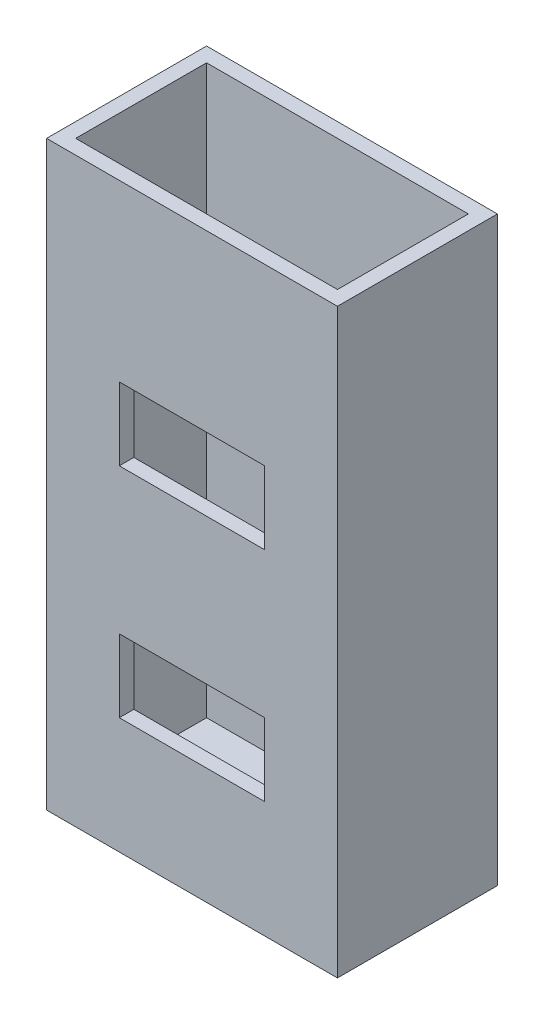
ISO-10303-21;
HEADER;
FILE_DESCRIPTION(('STEP AP214'),'2;1');
FILE_NAME('part.step','',(''),(''),'','','');
FILE_SCHEMA(('AUTOMOTIVE_DESIGN { 1 0 10303 214 1 1 1 1 }'));
ENDSEC;
DATA;
#1=APPLICATION_CONTEXT('core data for automotive mechanical design processes');
#2=APPLICATION_PROTOCOL_DEFINITION('international standard','automotive_design',2000,#1);
#3=PRODUCT_CONTEXT('',#1,'mechanical');
#4=PRODUCT('Part','Part','',(#3));
#5=PRODUCT_RELATED_PRODUCT_CATEGORY('part','',(#4));
#6=PRODUCT_DEFINITION_FORMATION('','',#4);
#7=PRODUCT_DEFINITION_CONTEXT('part definition',#1,'design');
#8=PRODUCT_DEFINITION('design','',#6,#7);
#9=PRODUCT_DEFINITION_SHAPE('','',#8);
#10=(LENGTH_UNIT() NAMED_UNIT(*) SI_UNIT(.MILLI.,.METRE.));
#11=(NAMED_UNIT(*) PLANE_ANGLE_UNIT() SI_UNIT($,.RADIAN.));
#12=(NAMED_UNIT(*) SI_UNIT($,.STERADIAN.) SOLID_ANGLE_UNIT());
#13=UNCERTAINTY_MEASURE_WITH_UNIT(LENGTH_MEASURE(1.E-05),#10,'distance_accuracy_value','');
#14=(GEOMETRIC_REPRESENTATION_CONTEXT(3) GLOBAL_UNCERTAINTY_ASSIGNED_CONTEXT((#13)) GLOBAL_UNIT_ASSIGNED_CONTEXT((#10,
#11,#12)) REPRESENTATION_CONTEXT('',''));
#15=CARTESIAN_POINT('',(0.,0.,0.));
#16=DIRECTION('',(0.,0.,1.));
#17=DIRECTION('',(1.,0.,0.));
#18=AXIS2_PLACEMENT_3D('',#15,#16,#17);
#19=CARTESIAN_POINT('',(0.,0.,11.));
#20=DIRECTION('',(0.,0.,1.));
#21=DIRECTION('',(1.,0.,0.));
#22=AXIS2_PLACEMENT_3D('',#19,#20,#21);
#23=PLANE('',#22);
#24=DIRECTION('',(0.,1.,0.));
#25=VECTOR('',#24,1.);
#26=CARTESIAN_POINT('',(-5.90971368462264,30.4024376593262,11.));
#27=LINE('',#26,#25);
#28=CARTESIAN_POINT('',(-5.90971368462263,-9.59756234067375,11.));
#29=VERTEX_POINT('',#28);
#30=CARTESIAN_POINT('',(-5.90971368462264,30.4024376593262,11.));
#31=VERTEX_POINT('',#30);
#32=EDGE_CURVE('E301',#29,#31,#27,.T.);
#33=ORIENTED_EDGE('',*,*,#32,.T.);
#34=DIRECTION('',(-1.,0.,0.));
#35=VECTOR('',#34,1.);
#36=CARTESIAN_POINT('',(-25.9097136846226,30.4024376593262,11.));
#37=LINE('',#36,#35);
#38=CARTESIAN_POINT('',(-25.9097136846226,30.4024376593262,11.));
#39=VERTEX_POINT('',#38);
#40=EDGE_CURVE('E305',#31,#39,#37,.T.);
#41=ORIENTED_EDGE('',*,*,#40,.T.);
#42=DIRECTION('',(0.,-1.,0.));
#43=VECTOR('',#42,1.);
#44=CARTESIAN_POINT('',(-25.9097136846226,30.4024376593262,11.));
#45=LINE('',#44,#43);
#46=CARTESIAN_POINT('',(-25.9097136846226,-9.59756234067375,11.));
#47=VERTEX_POINT('',#46);
#48=EDGE_CURVE('E309',#39,#47,#45,.T.);
#49=ORIENTED_EDGE('',*,*,#48,.T.);
#50=DIRECTION('',(1.,0.,0.));
#51=VECTOR('',#50,1.);
#52=CARTESIAN_POINT('',(-25.9097136846226,-9.59756234067375,11.));
#53=LINE('',#52,#51);
#54=EDGE_CURVE('E312',#47,#29,#53,.T.);
#55=ORIENTED_EDGE('',*,*,#54,.T.);
#56=EDGE_LOOP('',(#33,#41,#49,#55));
#57=FACE_BOUND('',#56,.T.);
#58=DIRECTION('',(1.,0.,0.));
#59=VECTOR('',#58,1.);
#60=CARTESIAN_POINT('',(0.,3.40243765932625,11.));
#61=LINE('',#60,#59);
#62=CARTESIAN_POINT('',(-20.9097136846226,3.40243765932625,11.));
#63=VERTEX_POINT('',#62);
#64=CARTESIAN_POINT('',(-10.9097136846226,3.40243765932625,11.));
#65=VERTEX_POINT('',#64);
#66=EDGE_CURVE('E242',#63,#65,#61,.T.);
#67=ORIENTED_EDGE('',*,*,#66,.T.);
#68=DIRECTION('',(0.,-1.,0.));
#69=VECTOR('',#68,1.);
#70=CARTESIAN_POINT('',(-10.9097136846226,0.,11.));
#71=LINE('',#70,#69);
#72=CARTESIAN_POINT('',(-10.9097136846226,-1.59756234067375,11.));
#73=VERTEX_POINT('',#72);
#74=EDGE_CURVE('E246',#65,#73,#71,.T.);
#75=ORIENTED_EDGE('',*,*,#74,.T.);
#76=DIRECTION('',(-1.,0.,0.));
#77=VECTOR('',#76,1.);
#78=CARTESIAN_POINT('',(0.,-1.59756234067375,11.));
#79=LINE('',#78,#77);
#80=CARTESIAN_POINT('',(-20.9097136846226,-1.59756234067375,11.));
#81=VERTEX_POINT('',#80);
#82=EDGE_CURVE('E214',#73,#81,#79,.T.);
#83=ORIENTED_EDGE('',*,*,#82,.T.);
#84=DIRECTION('',(0.,1.,0.));
#85=VECTOR('',#84,1.);
#86=CARTESIAN_POINT('',(-20.9097136846226,0.,11.));
#87=LINE('',#86,#85);
#88=EDGE_CURVE('E170',#81,#63,#87,.T.);
#89=ORIENTED_EDGE('',*,*,#88,.T.);
#90=EDGE_LOOP('',(#67,#75,#83,#89));
#91=FACE_BOUND('',#90,.T.);
#92=DIRECTION('',(1.,0.,0.));
#93=VECTOR('',#92,1.);
#94=CARTESIAN_POINT('',(0.,18.4024376593262,11.));
#95=LINE('',#94,#93);
#96=CARTESIAN_POINT('',(-20.9097136846226,18.4024376593262,11.));
#97=VERTEX_POINT('',#96);
#98=CARTESIAN_POINT('',(-10.9097136846226,18.4024376593262,11.));
#99=VERTEX_POINT('',#98);
#100=EDGE_CURVE('E255',#97,#99,#95,.T.);
#101=ORIENTED_EDGE('',*,*,#100,.T.);
#102=DIRECTION('',(0.,-1.,0.));
#103=VECTOR('',#102,1.);
#104=CARTESIAN_POINT('',(-10.9097136846226,0.,11.));
#105=LINE('',#104,#103);
#106=CARTESIAN_POINT('',(-10.9097136846226,13.4024376593262,11.));
#107=VERTEX_POINT('',#106);
#108=EDGE_CURVE('E212',#99,#107,#105,.T.);
#109=ORIENTED_EDGE('',*,*,#108,.T.);
#110=DIRECTION('',(-1.,0.,0.));
#111=VECTOR('',#110,1.);
#112=CARTESIAN_POINT('',(0.,13.4024376593262,11.));
#113=LINE('',#112,#111);
#114=CARTESIAN_POINT('',(-20.9097136846226,13.4024376593262,11.));
#115=VERTEX_POINT('',#114);
#116=EDGE_CURVE('E250',#107,#115,#113,.T.);
#117=ORIENTED_EDGE('',*,*,#116,.T.);
#118=DIRECTION('',(0.,1.,0.));
#119=VECTOR('',#118,1.);
#120=CARTESIAN_POINT('',(-20.9097136846226,0.,11.));
#121=LINE('',#120,#119);
#122=EDGE_CURVE('E221',#115,#97,#121,.T.);
#123=ORIENTED_EDGE('',*,*,#122,.T.);
#124=EDGE_LOOP('',(#101,#109,#117,#123));
#125=FACE_BOUND('',#124,.T.);
#126=ADVANCED_FACE('F41',(#57,#91,#125),#23,.T.);
#127=CARTESIAN_POINT('',(-24.9097136846226,-29.7221741381719,10.));
#128=DIRECTION('',(0.,0.,1.));
#129=DIRECTION('',(1.,0.,0.));
#130=AXIS2_PLACEMENT_3D('',#127,#128,#129);
#131=PLANE('',#130);
#132=DIRECTION('',(0.,-1.,0.));
#133=VECTOR('',#132,1.);
#134=CARTESIAN_POINT('',(-10.9097136846226,-29.7221741381719,10.));
#135=LINE('',#134,#133);
#136=CARTESIAN_POINT('',(-10.9097136846226,3.40243765932625,10.));
#137=VERTEX_POINT('',#136);
#138=CARTESIAN_POINT('',(-10.9097136846226,-1.59756234067375,10.));
#139=VERTEX_POINT('',#138);
#140=EDGE_CURVE('E182',#137,#139,#135,.T.);
#141=ORIENTED_EDGE('',*,*,#140,.F.);
#142=DIRECTION('',(1.,0.,0.));
#143=VECTOR('',#142,1.);
#144=CARTESIAN_POINT('',(-24.9097136846226,3.40243765932625,10.));
#145=LINE('',#144,#143);
#146=CARTESIAN_POINT('',(-20.9097136846226,3.40243765932625,10.));
#147=VERTEX_POINT('',#146);
#148=EDGE_CURVE('E178',#147,#137,#145,.T.);
#149=ORIENTED_EDGE('',*,*,#148,.F.);
#150=DIRECTION('',(0.,1.,0.));
#151=VECTOR('',#150,1.);
#152=CARTESIAN_POINT('',(-20.9097136846226,-29.7221741381719,10.));
#153=LINE('',#152,#151);
#154=CARTESIAN_POINT('',(-20.9097136846226,-1.59756234067375,10.));
#155=VERTEX_POINT('',#154);
#156=EDGE_CURVE('E162',#155,#147,#153,.T.);
#157=ORIENTED_EDGE('',*,*,#156,.F.);
#158=DIRECTION('',(-1.,0.,0.));
#159=VECTOR('',#158,1.);
#160=CARTESIAN_POINT('',(-24.9097136846226,-1.59756234067375,10.));
#161=LINE('',#160,#159);
#162=EDGE_CURVE('E153',#139,#155,#161,.T.);
#163=ORIENTED_EDGE('',*,*,#162,.F.);
#164=EDGE_LOOP('',(#141,#149,#157,#163));
#165=FACE_BOUND('',#164,.T.);
#166=DIRECTION('',(-1.,0.,0.));
#167=VECTOR('',#166,1.);
#168=CARTESIAN_POINT('',(-24.9097136846226,-8.59756234067375,10.));
#169=LINE('',#168,#167);
#170=CARTESIAN_POINT('',(-6.90971368462264,-8.59756234067375,10.));
#171=VERTEX_POINT('',#170);
#172=CARTESIAN_POINT('',(-24.9097136846226,-8.59756234067375,10.));
#173=VERTEX_POINT('',#172);
#174=EDGE_CURVE('E264',#171,#173,#169,.T.);
#175=ORIENTED_EDGE('',*,*,#174,.T.);
#176=DIRECTION('',(0.,1.,0.));
#177=VECTOR('',#176,1.);
#178=CARTESIAN_POINT('',(-24.9097136846226,-29.7221741381719,10.));
#179=LINE('',#178,#177);
#180=CARTESIAN_POINT('',(-24.9097136846226,30.4024376593262,10.));
#181=VERTEX_POINT('',#180);
#182=EDGE_CURVE('E289',#173,#181,#179,.T.);
#183=ORIENTED_EDGE('',*,*,#182,.T.);
#184=DIRECTION('',(1.,0.,0.));
#185=VECTOR('',#184,1.);
#186=CARTESIAN_POINT('',(-24.9097136846226,30.4024376593262,10.));
#187=LINE('',#186,#185);
#188=CARTESIAN_POINT('',(-6.90971368462264,30.4024376593262,10.));
#189=VERTEX_POINT('',#188);
#190=EDGE_CURVE('E282',#181,#189,#187,.T.);
#191=ORIENTED_EDGE('',*,*,#190,.T.);
#192=DIRECTION('',(0.,1.,0.));
#193=VECTOR('',#192,1.);
#194=CARTESIAN_POINT('',(-6.90971368462264,-29.7221741381719,10.));
#195=LINE('',#194,#193);
#196=EDGE_CURVE('E265',#171,#189,#195,.T.);
#197=ORIENTED_EDGE('',*,*,#196,.F.);
#198=EDGE_LOOP('',(#175,#183,#191,#197));
#199=FACE_BOUND('',#198,.T.);
#200=DIRECTION('',(0.,-1.,0.));
#201=VECTOR('',#200,1.);
#202=CARTESIAN_POINT('',(-10.9097136846226,-29.7221741381719,10.));
#203=LINE('',#202,#201);
#204=CARTESIAN_POINT('',(-10.9097136846226,18.4024376593262,10.));
#205=VERTEX_POINT('',#204);
#206=CARTESIAN_POINT('',(-10.9097136846226,13.4024376593262,10.));
#207=VERTEX_POINT('',#206);
#208=EDGE_CURVE('E12',#205,#207,#203,.T.);
#209=ORIENTED_EDGE('',*,*,#208,.F.);
#210=DIRECTION('',(1.,0.,0.));
#211=VECTOR('',#210,1.);
#212=CARTESIAN_POINT('',(-24.9097136846226,18.4024376593262,10.));
#213=LINE('',#212,#211);
#214=CARTESIAN_POINT('',(-20.9097136846226,18.4024376593262,10.));
#215=VERTEX_POINT('',#214);
#216=EDGE_CURVE('E50',#215,#205,#213,.T.);
#217=ORIENTED_EDGE('',*,*,#216,.F.);
#218=DIRECTION('',(0.,1.,0.));
#219=VECTOR('',#218,1.);
#220=CARTESIAN_POINT('',(-20.9097136846226,-29.7221741381719,10.));
#221=LINE('',#220,#219);
#222=CARTESIAN_POINT('',(-20.9097136846226,13.4024376593262,10.));
#223=VERTEX_POINT('',#222);
#224=EDGE_CURVE('E191',#223,#215,#221,.T.);
#225=ORIENTED_EDGE('',*,*,#224,.F.);
#226=DIRECTION('',(-1.,0.,0.));
#227=VECTOR('',#226,1.);
#228=CARTESIAN_POINT('',(-24.9097136846226,13.4024376593262,10.));
#229=LINE('',#228,#227);
#230=EDGE_CURVE('E188',#207,#223,#229,.T.);
#231=ORIENTED_EDGE('',*,*,#230,.F.);
#232=EDGE_LOOP('',(#209,#217,#225,#231));
#233=FACE_BOUND('',#232,.T.);
#234=ADVANCED_FACE('F176',(#165,#199,#233),#131,.F.);
#235=CARTESIAN_POINT('',(-5.90971368462264,30.4024376593262,11.));
#236=DIRECTION('',(-1.,0.,0.));
#237=DIRECTION('',(0.,-1.,0.));
#238=AXIS2_PLACEMENT_3D('',#235,#236,#237);
#239=PLANE('',#238);
#240=DIRECTION('',(0.,1.,0.));
#241=VECTOR('',#240,1.);
#242=CARTESIAN_POINT('',(-5.90971368462264,30.4024376593262,0.));
#243=LINE('',#242,#241);
#244=CARTESIAN_POINT('',(-5.90971368462263,-9.59756234067375,0.));
#245=VERTEX_POINT('',#244);
#246=CARTESIAN_POINT('',(-5.90971368462264,30.4024376593262,0.));
#247=VERTEX_POINT('',#246);
#248=EDGE_CURVE('E300',#245,#247,#243,.T.);
#249=ORIENTED_EDGE('',*,*,#248,.T.);
#250=DIRECTION('',(0.,0.,-1.));
#251=VECTOR('',#250,1.);
#252=CARTESIAN_POINT('',(-5.90971368462264,30.4024376593262,11.));
#253=LINE('',#252,#251);
#254=EDGE_CURVE('E163',#31,#247,#253,.T.);
#255=ORIENTED_EDGE('',*,*,#254,.F.);
#256=ORIENTED_EDGE('',*,*,#32,.F.);
#257=DIRECTION('',(0.,0.,-1.));
#258=VECTOR('',#257,1.);
#259=CARTESIAN_POINT('',(-5.90971368462263,-9.59756234067375,11.));
#260=LINE('',#259,#258);
#261=EDGE_CURVE('E315',#29,#245,#260,.T.);
#262=ORIENTED_EDGE('',*,*,#261,.T.);
#263=EDGE_LOOP('',(#249,#255,#256,#262));
#264=FACE_BOUND('',#263,.T.);
#265=ADVANCED_FACE('F43',(#264),#239,.F.);
#266=CARTESIAN_POINT('',(-25.9097136846226,30.4024376593262,11.));
#267=DIRECTION('',(0.,-1.,0.));
#268=DIRECTION('',(0.,0.,-1.));
#269=AXIS2_PLACEMENT_3D('',#266,#267,#268);
#270=PLANE('',#269);
#271=DIRECTION('',(-1.,0.,0.));
#272=VECTOR('',#271,1.);
#273=CARTESIAN_POINT('',(-24.9097136846226,30.4024376593262,1.));
#274=LINE('',#273,#272);
#275=CARTESIAN_POINT('',(-6.90971368462264,30.4024376593262,1.));
#276=VERTEX_POINT('',#275);
#277=CARTESIAN_POINT('',(-24.9097136846226,30.4024376593262,1.));
#278=VERTEX_POINT('',#277);
#279=EDGE_CURVE('E274',#276,#278,#274,.T.);
#280=ORIENTED_EDGE('',*,*,#279,.F.);
#281=DIRECTION('',(0.,0.,-1.));
#282=VECTOR('',#281,1.);
#283=CARTESIAN_POINT('',(-6.90971368462264,30.4024376593262,1.));
#284=LINE('',#283,#282);
#285=EDGE_CURVE('E260',#189,#276,#284,.T.);
#286=ORIENTED_EDGE('',*,*,#285,.F.);
#287=ORIENTED_EDGE('',*,*,#190,.F.);
#288=DIRECTION('',(0.,0.,1.));
#289=VECTOR('',#288,1.);
#290=CARTESIAN_POINT('',(-24.9097136846226,30.4024376593262,1.));
#291=LINE('',#290,#289);
#292=EDGE_CURVE('E278',#278,#181,#291,.T.);
#293=ORIENTED_EDGE('',*,*,#292,.F.);
#294=EDGE_LOOP('',(#280,#286,#287,#293));
#295=FACE_BOUND('',#294,.T.);
#296=DIRECTION('',(-1.,0.,0.));
#297=VECTOR('',#296,1.);
#298=CARTESIAN_POINT('',(-25.9097136846226,30.4024376593262,0.));
#299=LINE('',#298,#297);
#300=CARTESIAN_POINT('',(-25.9097136846226,30.4024376593262,0.));
#301=VERTEX_POINT('',#300);
#302=EDGE_CURVE('E319',#247,#301,#299,.T.);
#303=ORIENTED_EDGE('',*,*,#302,.T.);
#304=DIRECTION('',(0.,0.,-1.));
#305=VECTOR('',#304,1.);
#306=CARTESIAN_POINT('',(-25.9097136846226,30.4024376593262,11.));
#307=LINE('',#306,#305);
#308=EDGE_CURVE('E334',#39,#301,#307,.T.);
#309=ORIENTED_EDGE('',*,*,#308,.F.);
#310=ORIENTED_EDGE('',*,*,#40,.F.);
#311=ORIENTED_EDGE('',*,*,#254,.T.);
#312=EDGE_LOOP('',(#303,#309,#310,#311));
#313=FACE_BOUND('',#312,.T.);
#314=ADVANCED_FACE('F341',(#295,#313),#270,.F.);
#315=CARTESIAN_POINT('',(-25.9097136846226,30.4024376593262,11.));
#316=DIRECTION('',(1.,0.,0.));
#317=DIRECTION('',(0.,0.,-1.));
#318=AXIS2_PLACEMENT_3D('',#315,#316,#317);
#319=PLANE('',#318);
#320=DIRECTION('',(0.,-1.,0.));
#321=VECTOR('',#320,1.);
#322=CARTESIAN_POINT('',(-25.9097136846226,30.4024376593262,0.));
#323=LINE('',#322,#321);
#324=CARTESIAN_POINT('',(-25.9097136846226,-9.59756234067375,0.));
#325=VERTEX_POINT('',#324);
#326=EDGE_CURVE('E322',#301,#325,#323,.T.);
#327=ORIENTED_EDGE('',*,*,#326,.T.);
#328=DIRECTION('',(0.,0.,-1.));
#329=VECTOR('',#328,1.);
#330=CARTESIAN_POINT('',(-25.9097136846226,-9.59756234067375,11.));
#331=LINE('',#330,#329);
#332=EDGE_CURVE('E330',#47,#325,#331,.T.);
#333=ORIENTED_EDGE('',*,*,#332,.F.);
#334=ORIENTED_EDGE('',*,*,#48,.F.);
#335=ORIENTED_EDGE('',*,*,#308,.T.);
#336=EDGE_LOOP('',(#327,#333,#334,#335));
#337=FACE_BOUND('',#336,.T.);
#338=ADVANCED_FACE('F353',(#337),#319,.F.);
#339=CARTESIAN_POINT('',(-25.9097136846226,-9.59756234067375,11.));
#340=DIRECTION('',(0.,1.,0.));
#341=DIRECTION('',(0.,0.,1.));
#342=AXIS2_PLACEMENT_3D('',#339,#340,#341);
#343=PLANE('',#342);
#344=DIRECTION('',(1.,0.,0.));
#345=VECTOR('',#344,1.);
#346=CARTESIAN_POINT('',(-25.9097136846226,-9.59756234067375,0.));
#347=LINE('',#346,#345);
#348=EDGE_CURVE('E306',#325,#245,#347,.T.);
#349=ORIENTED_EDGE('',*,*,#348,.T.);
#350=ORIENTED_EDGE('',*,*,#261,.F.);
#351=ORIENTED_EDGE('',*,*,#54,.F.);
#352=ORIENTED_EDGE('',*,*,#332,.T.);
#353=EDGE_LOOP('',(#349,#350,#351,#352));
#354=FACE_BOUND('',#353,.T.);
#355=ADVANCED_FACE('F357',(#354),#343,.F.);
#356=CARTESIAN_POINT('',(0.,0.,0.));
#357=DIRECTION('',(0.,0.,1.));
#358=DIRECTION('',(1.,0.,0.));
#359=AXIS2_PLACEMENT_3D('',#356,#357,#358);
#360=PLANE('',#359);
#361=ORIENTED_EDGE('',*,*,#248,.F.);
#362=ORIENTED_EDGE('',*,*,#348,.F.);
#363=ORIENTED_EDGE('',*,*,#326,.F.);
#364=ORIENTED_EDGE('',*,*,#302,.F.);
#365=EDGE_LOOP('',(#361,#362,#363,#364));
#366=FACE_BOUND('',#365,.T.);
#367=ADVANCED_FACE('F349',(#366),#360,.F.);
#368=CARTESIAN_POINT('',(-6.90971368462264,-29.7221741381719,1.));
#369=DIRECTION('',(1.,0.,0.));
#370=DIRECTION('',(0.,0.,-1.));
#371=AXIS2_PLACEMENT_3D('',#368,#369,#370);
#372=PLANE('',#371);
#373=DIRECTION('',(0.,0.,1.));
#374=VECTOR('',#373,1.);
#375=CARTESIAN_POINT('',(-6.90971368462264,-8.59756234067375,1.));
#376=LINE('',#375,#374);
#377=CARTESIAN_POINT('',(-6.90971368462264,-8.59756234067375,1.));
#378=VERTEX_POINT('',#377);
#379=EDGE_CURVE('E268',#378,#171,#376,.T.);
#380=ORIENTED_EDGE('',*,*,#379,.T.);
#381=ORIENTED_EDGE('',*,*,#196,.T.);
#382=ORIENTED_EDGE('',*,*,#285,.T.);
#383=DIRECTION('',(0.,1.,0.));
#384=VECTOR('',#383,1.);
#385=CARTESIAN_POINT('',(-6.90971368462264,-29.7221741381719,1.));
#386=LINE('',#385,#384);
#387=EDGE_CURVE('E286',#378,#276,#386,.T.);
#388=ORIENTED_EDGE('',*,*,#387,.F.);
#389=EDGE_LOOP('',(#380,#381,#382,#388));
#390=FACE_BOUND('',#389,.T.);
#391=ADVANCED_FACE('F386',(#390),#372,.F.);
#392=CARTESIAN_POINT('',(-24.9097136846226,-29.7221741381719,1.));
#393=DIRECTION('',(-1.,0.,0.));
#394=DIRECTION('',(0.,0.,1.));
#395=AXIS2_PLACEMENT_3D('',#392,#393,#394);
#396=PLANE('',#395);
#397=DIRECTION('',(0.,0.,-1.));
#398=VECTOR('',#397,1.);
#399=CARTESIAN_POINT('',(-24.9097136846226,-8.59756234067375,1.));
#400=LINE('',#399,#398);
#401=CARTESIAN_POINT('',(-24.9097136846226,-8.59756234067376,1.));
#402=VERTEX_POINT('',#401);
#403=EDGE_CURVE('E261',#173,#402,#400,.T.);
#404=ORIENTED_EDGE('',*,*,#403,.T.);
#405=DIRECTION('',(0.,1.,0.));
#406=VECTOR('',#405,1.);
#407=CARTESIAN_POINT('',(-24.9097136846226,-29.7221741381719,1.));
#408=LINE('',#407,#406);
#409=EDGE_CURVE('E292',#402,#278,#408,.T.);
#410=ORIENTED_EDGE('',*,*,#409,.T.);
#411=ORIENTED_EDGE('',*,*,#292,.T.);
#412=ORIENTED_EDGE('',*,*,#182,.F.);
#413=EDGE_LOOP('',(#404,#410,#411,#412));
#414=FACE_BOUND('',#413,.T.);
#415=ADVANCED_FACE('F383',(#414),#396,.F.);
#416=CARTESIAN_POINT('',(-24.9097136846226,-29.7221741381719,1.));
#417=DIRECTION('',(0.,0.,-1.));
#418=DIRECTION('',(-1.,0.,0.));
#419=AXIS2_PLACEMENT_3D('',#416,#417,#418);
#420=PLANE('',#419);
#421=DIRECTION('',(1.,0.,0.));
#422=VECTOR('',#421,1.);
#423=CARTESIAN_POINT('',(-24.9097136846226,-8.59756234067375,1.));
#424=LINE('',#423,#422);
#425=EDGE_CURVE('E271',#402,#378,#424,.T.);
#426=ORIENTED_EDGE('',*,*,#425,.T.);
#427=ORIENTED_EDGE('',*,*,#387,.T.);
#428=ORIENTED_EDGE('',*,*,#279,.T.);
#429=ORIENTED_EDGE('',*,*,#409,.F.);
#430=EDGE_LOOP('',(#426,#427,#428,#429));
#431=FACE_BOUND('',#430,.T.);
#432=ADVANCED_FACE('F376',(#431),#420,.F.);
#433=CARTESIAN_POINT('',(-25.9097136846226,-8.59756234067375,11.));
#434=DIRECTION('',(0.,1.,0.));
#435=DIRECTION('',(0.,0.,1.));
#436=AXIS2_PLACEMENT_3D('',#433,#434,#435);
#437=PLANE('',#436);
#438=ORIENTED_EDGE('',*,*,#379,.F.);
#439=ORIENTED_EDGE('',*,*,#425,.F.);
#440=ORIENTED_EDGE('',*,*,#403,.F.);
#441=ORIENTED_EDGE('',*,*,#174,.F.);
#442=EDGE_LOOP('',(#438,#439,#440,#441));
#443=FACE_BOUND('',#442,.T.);
#444=ADVANCED_FACE('F369',(#443),#437,.T.);
#445=CARTESIAN_POINT('',(-10.9097136846226,3.40243765932625,17.));
#446=DIRECTION('',(-1.,0.,0.));
#447=DIRECTION('',(0.,0.,1.));
#448=AXIS2_PLACEMENT_3D('',#445,#446,#447);
#449=PLANE('',#448);
#450=DIRECTION('',(0.,0.,-1.));
#451=VECTOR('',#450,1.);
#452=CARTESIAN_POINT('',(-10.9097136846226,3.40243765932625,17.));
#453=LINE('',#452,#451);
#454=EDGE_CURVE('E228',#65,#137,#453,.T.);
#455=ORIENTED_EDGE('',*,*,#454,.T.);
#456=ORIENTED_EDGE('',*,*,#140,.T.);
#457=DIRECTION('',(0.,0.,-1.));
#458=VECTOR('',#457,1.);
#459=CARTESIAN_POINT('',(-10.9097136846226,-1.59756234067375,17.));
#460=LINE('',#459,#458);
#461=EDGE_CURVE('E156',#73,#139,#460,.T.);
#462=ORIENTED_EDGE('',*,*,#461,.F.);
#463=ORIENTED_EDGE('',*,*,#74,.F.);
#464=EDGE_LOOP('',(#455,#456,#462,#463));
#465=FACE_BOUND('',#464,.T.);
#466=ADVANCED_FACE('F367',(#465),#449,.T.);
#467=CARTESIAN_POINT('',(-20.9097136846226,3.40243765932625,17.));
#468=DIRECTION('',(0.,-1.,0.));
#469=DIRECTION('',(0.,0.,-1.));
#470=AXIS2_PLACEMENT_3D('',#467,#468,#469);
#471=PLANE('',#470);
#472=DIRECTION('',(0.,0.,-1.));
#473=VECTOR('',#472,1.);
#474=CARTESIAN_POINT('',(-20.9097136846226,3.40243765932625,17.));
#475=LINE('',#474,#473);
#476=EDGE_CURVE('E173',#63,#147,#475,.T.);
#477=ORIENTED_EDGE('',*,*,#476,.T.);
#478=ORIENTED_EDGE('',*,*,#148,.T.);
#479=ORIENTED_EDGE('',*,*,#454,.F.);
#480=ORIENTED_EDGE('',*,*,#66,.F.);
#481=EDGE_LOOP('',(#477,#478,#479,#480));
#482=FACE_BOUND('',#481,.T.);
#483=ADVANCED_FACE('F365',(#482),#471,.T.);
#484=CARTESIAN_POINT('',(-20.9097136846226,3.40243765932625,17.));
#485=DIRECTION('',(1.,0.,0.));
#486=DIRECTION('',(0.,1.,0.));
#487=AXIS2_PLACEMENT_3D('',#484,#485,#486);
#488=PLANE('',#487);
#489=DIRECTION('',(0.,0.,-1.));
#490=VECTOR('',#489,1.);
#491=CARTESIAN_POINT('',(-20.9097136846226,-1.59756234067375,17.));
#492=LINE('',#491,#490);
#493=EDGE_CURVE('E65',#81,#155,#492,.T.);
#494=ORIENTED_EDGE('',*,*,#493,.T.);
#495=ORIENTED_EDGE('',*,*,#156,.T.);
#496=ORIENTED_EDGE('',*,*,#476,.F.);
#497=ORIENTED_EDGE('',*,*,#88,.F.);
#498=EDGE_LOOP('',(#494,#495,#496,#497));
#499=FACE_BOUND('',#498,.T.);
#500=ADVANCED_FACE('F166',(#499),#488,.T.);
#501=CARTESIAN_POINT('',(-20.9097136846226,-1.59756234067375,17.));
#502=DIRECTION('',(0.,1.,0.));
#503=DIRECTION('',(0.,0.,1.));
#504=AXIS2_PLACEMENT_3D('',#501,#502,#503);
#505=PLANE('',#504);
#506=ORIENTED_EDGE('',*,*,#461,.T.);
#507=ORIENTED_EDGE('',*,*,#162,.T.);
#508=ORIENTED_EDGE('',*,*,#493,.F.);
#509=ORIENTED_EDGE('',*,*,#82,.F.);
#510=EDGE_LOOP('',(#506,#507,#508,#509));
#511=FACE_BOUND('',#510,.T.);
#512=ADVANCED_FACE('F154',(#511),#505,.T.);
#513=CARTESIAN_POINT('',(-10.9097136846226,18.4024376593262,17.));
#514=DIRECTION('',(-1.,0.,0.));
#515=DIRECTION('',(0.,-1.,0.));
#516=AXIS2_PLACEMENT_3D('',#513,#514,#515);
#517=PLANE('',#516);
#518=DIRECTION('',(0.,0.,-1.));
#519=VECTOR('',#518,1.);
#520=CARTESIAN_POINT('',(-10.9097136846226,18.4024376593262,17.));
#521=LINE('',#520,#519);
#522=EDGE_CURVE('E200',#99,#205,#521,.T.);
#523=ORIENTED_EDGE('',*,*,#522,.T.);
#524=ORIENTED_EDGE('',*,*,#208,.T.);
#525=DIRECTION('',(0.,0.,-1.));
#526=VECTOR('',#525,1.);
#527=CARTESIAN_POINT('',(-10.9097136846226,13.4024376593262,17.));
#528=LINE('',#527,#526);
#529=EDGE_CURVE('E217',#107,#207,#528,.T.);
#530=ORIENTED_EDGE('',*,*,#529,.F.);
#531=ORIENTED_EDGE('',*,*,#108,.F.);
#532=EDGE_LOOP('',(#523,#524,#530,#531));
#533=FACE_BOUND('',#532,.T.);
#534=ADVANCED_FACE('F208',(#533),#517,.T.);
#535=CARTESIAN_POINT('',(-20.9097136846226,18.4024376593262,17.));
#536=DIRECTION('',(0.,-1.,0.));
#537=DIRECTION('',(0.,0.,-1.));
#538=AXIS2_PLACEMENT_3D('',#535,#536,#537);
#539=PLANE('',#538);
#540=DIRECTION('',(0.,0.,-1.));
#541=VECTOR('',#540,1.);
#542=CARTESIAN_POINT('',(-20.9097136846226,18.4024376593262,17.));
#543=LINE('',#542,#541);
#544=EDGE_CURVE('E203',#97,#215,#543,.T.);
#545=ORIENTED_EDGE('',*,*,#544,.T.);
#546=ORIENTED_EDGE('',*,*,#216,.T.);
#547=ORIENTED_EDGE('',*,*,#522,.F.);
#548=ORIENTED_EDGE('',*,*,#100,.F.);
#549=EDGE_LOOP('',(#545,#546,#547,#548));
#550=FACE_BOUND('',#549,.T.);
#551=ADVANCED_FACE('F199',(#550),#539,.T.);
#552=CARTESIAN_POINT('',(-20.9097136846226,18.4024376593262,17.));
#553=DIRECTION('',(1.,0.,0.));
#554=DIRECTION('',(0.,0.,-1.));
#555=AXIS2_PLACEMENT_3D('',#552,#553,#554);
#556=PLANE('',#555);
#557=DIRECTION('',(0.,0.,-1.));
#558=VECTOR('',#557,1.);
#559=CARTESIAN_POINT('',(-20.9097136846226,13.4024376593262,17.));
#560=LINE('',#559,#558);
#561=EDGE_CURVE('E57',#115,#223,#560,.T.);
#562=ORIENTED_EDGE('',*,*,#561,.T.);
#563=ORIENTED_EDGE('',*,*,#224,.T.);
#564=ORIENTED_EDGE('',*,*,#544,.F.);
#565=ORIENTED_EDGE('',*,*,#122,.F.);
#566=EDGE_LOOP('',(#562,#563,#564,#565));
#567=FACE_BOUND('',#566,.T.);
#568=ADVANCED_FACE('F219',(#567),#556,.T.);
#569=CARTESIAN_POINT('',(-20.9097136846226,13.4024376593262,17.));
#570=DIRECTION('',(0.,1.,0.));
#571=DIRECTION('',(0.,0.,1.));
#572=AXIS2_PLACEMENT_3D('',#569,#570,#571);
#573=PLANE('',#572);
#574=ORIENTED_EDGE('',*,*,#529,.T.);
#575=ORIENTED_EDGE('',*,*,#230,.T.);
#576=ORIENTED_EDGE('',*,*,#561,.F.);
#577=ORIENTED_EDGE('',*,*,#116,.F.);
#578=EDGE_LOOP('',(#574,#575,#576,#577));
#579=FACE_BOUND('',#578,.T.);
#580=ADVANCED_FACE('F216',(#579),#573,.T.);
#581=CLOSED_SHELL('',(#126,#234,#265,#314,#338,#355,#367,#391,#415,#432,#444,#466,#483,#500,
#512,#534,#551,#568,#580));
#582=MANIFOLD_SOLID_BREP('B2',#581);
#583=ADVANCED_BREP_SHAPE_REPRESENTATION('',(#18,#582),#14);
#584=SHAPE_DEFINITION_REPRESENTATION(#9,#583);
ENDSEC;
END-ISO-10303-21;
